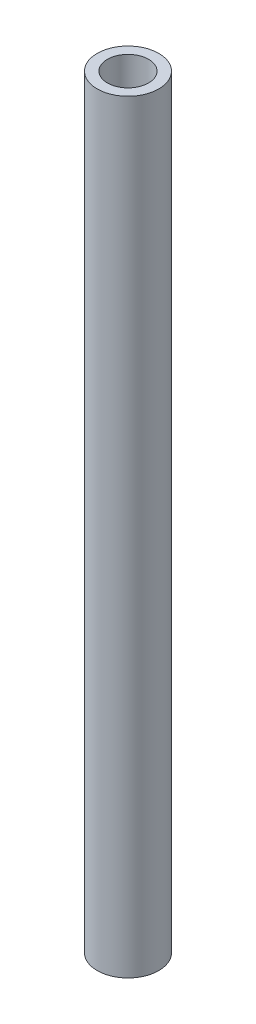
ISO-10303-21;
HEADER;
FILE_DESCRIPTION(('STEP AP214'),'2;1');
FILE_NAME('part.step','',(''),(''),'','','');
FILE_SCHEMA(('AUTOMOTIVE_DESIGN { 1 0 10303 214 1 1 1 1 }'));
ENDSEC;
DATA;
#1=APPLICATION_CONTEXT('core data for automotive mechanical design processes');
#2=APPLICATION_PROTOCOL_DEFINITION('international standard','automotive_design',2000,#1);
#3=PRODUCT_CONTEXT('',#1,'mechanical');
#4=PRODUCT('Part','Part','',(#3));
#5=PRODUCT_RELATED_PRODUCT_CATEGORY('part','',(#4));
#6=PRODUCT_DEFINITION_FORMATION('','',#4);
#7=PRODUCT_DEFINITION_CONTEXT('part definition',#1,'design');
#8=PRODUCT_DEFINITION('design','',#6,#7);
#9=PRODUCT_DEFINITION_SHAPE('','',#8);
#10=(LENGTH_UNIT() NAMED_UNIT(*) SI_UNIT(.MILLI.,.METRE.));
#11=(NAMED_UNIT(*) PLANE_ANGLE_UNIT() SI_UNIT($,.RADIAN.));
#12=(NAMED_UNIT(*) SI_UNIT($,.STERADIAN.) SOLID_ANGLE_UNIT());
#13=UNCERTAINTY_MEASURE_WITH_UNIT(LENGTH_MEASURE(1.E-05),#10,'distance_accuracy_value','');
#14=(GEOMETRIC_REPRESENTATION_CONTEXT(3) GLOBAL_UNCERTAINTY_ASSIGNED_CONTEXT((#13)) GLOBAL_UNIT_ASSIGNED_CONTEXT((#10,
#11,#12)) REPRESENTATION_CONTEXT('',''));
#15=CARTESIAN_POINT('',(0.,0.,0.));
#16=DIRECTION('',(0.,0.,1.));
#17=DIRECTION('',(1.,0.,0.));
#18=AXIS2_PLACEMENT_3D('',#15,#16,#17);
#19=CARTESIAN_POINT('',(0.,310.,0.));
#20=DIRECTION('',(0.,1.,0.));
#21=DIRECTION('',(0.,0.,1.));
#22=AXIS2_PLACEMENT_3D('',#19,#20,#21);
#23=PLANE('',#22);
#24=CARTESIAN_POINT('',(0.,310.,0.));
#25=DIRECTION('',(0.,1.,0.));
#26=DIRECTION('',(0.,0.,1.));
#27=AXIS2_PLACEMENT_3D('',#24,#25,#26);
#28=CIRCLE('',#27,25.);
#29=CARTESIAN_POINT('',(0.,310.,25.));
#30=VERTEX_POINT('',#29);
#31=EDGE_CURVE('E10',#30,#30,#28,.T.);
#32=ORIENTED_EDGE('',*,*,#31,.T.);
#33=EDGE_LOOP('',(#32));
#34=FACE_BOUND('',#33,.T.);
#35=CARTESIAN_POINT('',(0.,310.,0.));
#36=DIRECTION('',(0.,1.,0.));
#37=DIRECTION('',(0.,0.,1.));
#38=AXIS2_PLACEMENT_3D('',#35,#36,#37);
#39=CIRCLE('',#38,16.7);
#40=CARTESIAN_POINT('',(0.,310.,16.7));
#41=VERTEX_POINT('',#40);
#42=EDGE_CURVE('E41',#41,#41,#39,.T.);
#43=ORIENTED_EDGE('',*,*,#42,.F.);
#44=EDGE_LOOP('',(#43));
#45=FACE_BOUND('',#44,.T.);
#46=ADVANCED_FACE('F30',(#34,#45),#23,.T.);
#47=CARTESIAN_POINT('',(0.,-310.,0.));
#48=DIRECTION('',(0.,1.,0.));
#49=DIRECTION('',(0.,0.,1.));
#50=AXIS2_PLACEMENT_3D('',#47,#48,#49);
#51=PLANE('',#50);
#52=CARTESIAN_POINT('',(0.,-310.,0.));
#53=DIRECTION('',(0.,1.,0.));
#54=DIRECTION('',(0.,0.,1.));
#55=AXIS2_PLACEMENT_3D('',#52,#53,#54);
#56=CIRCLE('',#55,25.);
#57=CARTESIAN_POINT('',(0.,-310.,25.));
#58=VERTEX_POINT('',#57);
#59=EDGE_CURVE('E34',#58,#58,#56,.T.);
#60=ORIENTED_EDGE('',*,*,#59,.F.);
#61=EDGE_LOOP('',(#60));
#62=FACE_BOUND('',#61,.T.);
#63=CARTESIAN_POINT('',(0.,-310.,0.));
#64=DIRECTION('',(0.,1.,0.));
#65=DIRECTION('',(0.,0.,1.));
#66=AXIS2_PLACEMENT_3D('',#63,#64,#65);
#67=CIRCLE('',#66,16.7);
#68=CARTESIAN_POINT('',(0.,-310.,16.7));
#69=VERTEX_POINT('',#68);
#70=EDGE_CURVE('E43',#69,#69,#67,.T.);
#71=ORIENTED_EDGE('',*,*,#70,.T.);
#72=EDGE_LOOP('',(#71));
#73=FACE_BOUND('',#72,.T.);
#74=ADVANCED_FACE('F53',(#62,#73),#51,.F.);
#75=CARTESIAN_POINT('',(0.,310.,0.));
#76=DIRECTION('',(0.,-1.,0.));
#77=DIRECTION('',(0.,0.,-1.));
#78=AXIS2_PLACEMENT_3D('',#75,#76,#77);
#79=CYLINDRICAL_SURFACE('',#78,25.);
#80=ORIENTED_EDGE('',*,*,#31,.F.);
#81=EDGE_LOOP('',(#80));
#82=FACE_BOUND('',#81,.T.);
#83=ORIENTED_EDGE('',*,*,#59,.T.);
#84=EDGE_LOOP('',(#83));
#85=FACE_BOUND('',#84,.T.);
#86=ADVANCED_FACE('F32',(#82,#85),#79,.T.);
#87=CARTESIAN_POINT('',(0.,310.,0.));
#88=DIRECTION('',(0.,-1.,0.));
#89=DIRECTION('',(0.,0.,-1.));
#90=AXIS2_PLACEMENT_3D('',#87,#88,#89);
#91=CYLINDRICAL_SURFACE('',#90,16.7);
#92=ORIENTED_EDGE('',*,*,#42,.T.);
#93=EDGE_LOOP('',(#92));
#94=FACE_BOUND('',#93,.T.);
#95=ORIENTED_EDGE('',*,*,#70,.F.);
#96=EDGE_LOOP('',(#95));
#97=FACE_BOUND('',#96,.T.);
#98=ADVANCED_FACE('F49',(#94,#97),#91,.F.);
#99=CLOSED_SHELL('',(#46,#74,#86,#98));
#100=MANIFOLD_SOLID_BREP('B2',#99);
#101=ADVANCED_BREP_SHAPE_REPRESENTATION('',(#18,#100),#14);
#102=SHAPE_DEFINITION_REPRESENTATION(#9,#101);
ENDSEC;
END-ISO-10303-21;
